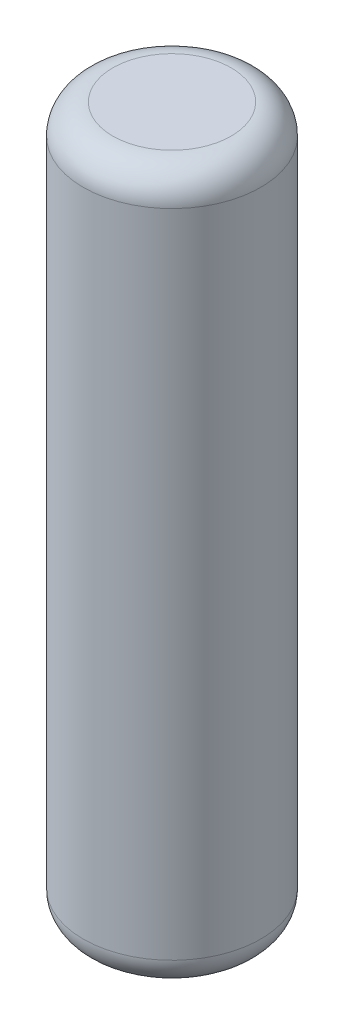
ISO-10303-21;
HEADER;
FILE_DESCRIPTION(('STEP AP214'),'2;1');
FILE_NAME('part.step','',(''),(''),'','','');
FILE_SCHEMA(('AUTOMOTIVE_DESIGN { 1 0 10303 214 1 1 1 1 }'));
ENDSEC;
DATA;
#1=APPLICATION_CONTEXT('core data for automotive mechanical design processes');
#2=APPLICATION_PROTOCOL_DEFINITION('international standard','automotive_design',2000,#1);
#3=PRODUCT_CONTEXT('',#1,'mechanical');
#4=PRODUCT('Part','Part','',(#3));
#5=PRODUCT_RELATED_PRODUCT_CATEGORY('part','',(#4));
#6=PRODUCT_DEFINITION_FORMATION('','',#4);
#7=PRODUCT_DEFINITION_CONTEXT('part definition',#1,'design');
#8=PRODUCT_DEFINITION('design','',#6,#7);
#9=PRODUCT_DEFINITION_SHAPE('','',#8);
#10=(LENGTH_UNIT() NAMED_UNIT(*) SI_UNIT(.MILLI.,.METRE.));
#11=(NAMED_UNIT(*) PLANE_ANGLE_UNIT() SI_UNIT($,.RADIAN.));
#12=(NAMED_UNIT(*) SI_UNIT($,.STERADIAN.) SOLID_ANGLE_UNIT());
#13=UNCERTAINTY_MEASURE_WITH_UNIT(LENGTH_MEASURE(1.E-05),#10,'distance_accuracy_value','');
#14=(GEOMETRIC_REPRESENTATION_CONTEXT(3) GLOBAL_UNCERTAINTY_ASSIGNED_CONTEXT((#13)) GLOBAL_UNIT_ASSIGNED_CONTEXT((#10,
#11,#12)) REPRESENTATION_CONTEXT('',''));
#15=CARTESIAN_POINT('',(0.,0.,0.));
#16=DIRECTION('',(0.,0.,1.));
#17=DIRECTION('',(1.,0.,0.));
#18=AXIS2_PLACEMENT_3D('',#15,#16,#17);
#19=CARTESIAN_POINT('',(0.,240.,0.));
#20=DIRECTION('',(0.,-1.,0.));
#21=DIRECTION('',(0.,0.,-1.));
#22=AXIS2_PLACEMENT_3D('',#19,#20,#21);
#23=CYLINDRICAL_SURFACE('',#22,30.);
#24=CARTESIAN_POINT('',(0.,10.,0.));
#25=DIRECTION('',(0.,1.,0.));
#26=DIRECTION('',(0.,0.,1.));
#27=AXIS2_PLACEMENT_3D('',#24,#25,#26);
#28=CIRCLE('',#27,30.);
#29=CARTESIAN_POINT('',(0.,10.,30.));
#30=VERTEX_POINT('',#29);
#31=EDGE_CURVE('E43',#30,#30,#28,.T.);
#32=ORIENTED_EDGE('',*,*,#31,.T.);
#33=EDGE_LOOP('',(#32));
#34=FACE_BOUND('',#33,.T.);
#35=CARTESIAN_POINT('',(0.,230.,0.));
#36=DIRECTION('',(0.,1.,0.));
#37=DIRECTION('',(0.,0.,1.));
#38=AXIS2_PLACEMENT_3D('',#35,#36,#37);
#39=CIRCLE('',#38,30.);
#40=CARTESIAN_POINT('',(0.,230.,30.));
#41=VERTEX_POINT('',#40);
#42=EDGE_CURVE('E47',#41,#41,#39,.F.);
#43=ORIENTED_EDGE('',*,*,#42,.T.);
#44=EDGE_LOOP('',(#43));
#45=FACE_BOUND('',#44,.T.);
#46=ADVANCED_FACE('F32',(#34,#45),#23,.T.);
#47=CARTESIAN_POINT('',(0.,240.,0.));
#48=DIRECTION('',(0.,1.,0.));
#49=DIRECTION('',(0.,0.,1.));
#50=AXIS2_PLACEMENT_3D('',#47,#48,#49);
#51=PLANE('',#50);
#52=CARTESIAN_POINT('',(0.,240.,0.));
#53=DIRECTION('',(0.,1.,0.));
#54=DIRECTION('',(0.,0.,1.));
#55=AXIS2_PLACEMENT_3D('',#52,#53,#54);
#56=CIRCLE('',#55,20.);
#57=CARTESIAN_POINT('',(0.,240.,20.));
#58=VERTEX_POINT('',#57);
#59=EDGE_CURVE('E10',#58,#58,#56,.T.);
#60=ORIENTED_EDGE('',*,*,#59,.T.);
#61=EDGE_LOOP('',(#60));
#62=FACE_BOUND('',#61,.T.);
#63=ADVANCED_FACE('F63',(#62),#51,.T.);
#64=CARTESIAN_POINT('',(0.,0.,0.));
#65=DIRECTION('',(0.,1.,0.));
#66=DIRECTION('',(0.,0.,1.));
#67=AXIS2_PLACEMENT_3D('',#64,#65,#66);
#68=PLANE('',#67);
#69=CARTESIAN_POINT('',(0.,0.,0.));
#70=DIRECTION('',(0.,1.,0.));
#71=DIRECTION('',(0.,0.,1.));
#72=AXIS2_PLACEMENT_3D('',#69,#70,#71);
#73=CIRCLE('',#72,20.);
#74=CARTESIAN_POINT('',(0.,0.,20.));
#75=VERTEX_POINT('',#74);
#76=EDGE_CURVE('E39',#75,#75,#73,.F.);
#77=ORIENTED_EDGE('',*,*,#76,.T.);
#78=EDGE_LOOP('',(#77));
#79=FACE_BOUND('',#78,.T.);
#80=ADVANCED_FACE('F60',(#79),#68,.F.);
#81=CARTESIAN_POINT('',(0.,10.,0.));
#82=DIRECTION('',(0.,1.,0.));
#83=DIRECTION('',(0.,0.,1.));
#84=AXIS2_PLACEMENT_3D('',#81,#82,#83);
#85=TOROIDAL_SURFACE('',#84,20.,10.);
#86=ORIENTED_EDGE('',*,*,#76,.F.);
#87=EDGE_LOOP('',(#86));
#88=FACE_BOUND('',#87,.T.);
#89=ORIENTED_EDGE('',*,*,#31,.F.);
#90=EDGE_LOOP('',(#89));
#91=FACE_BOUND('',#90,.T.);
#92=ADVANCED_FACE('F56',(#88,#91),#85,.T.);
#93=CARTESIAN_POINT('',(0.,230.,0.));
#94=DIRECTION('',(0.,1.,0.));
#95=DIRECTION('',(0.,0.,1.));
#96=AXIS2_PLACEMENT_3D('',#93,#94,#95);
#97=TOROIDAL_SURFACE('',#96,20.,10.);
#98=ORIENTED_EDGE('',*,*,#42,.F.);
#99=EDGE_LOOP('',(#98));
#100=FACE_BOUND('',#99,.T.);
#101=ORIENTED_EDGE('',*,*,#59,.F.);
#102=EDGE_LOOP('',(#101));
#103=FACE_BOUND('',#102,.T.);
#104=ADVANCED_FACE('F34',(#100,#103),#97,.T.);
#105=CLOSED_SHELL('',(#46,#63,#80,#92,#104));
#106=MANIFOLD_SOLID_BREP('B2',#105);
#107=ADVANCED_BREP_SHAPE_REPRESENTATION('',(#18,#106),#14);
#108=SHAPE_DEFINITION_REPRESENTATION(#9,#107);
ENDSEC;
END-ISO-10303-21;
